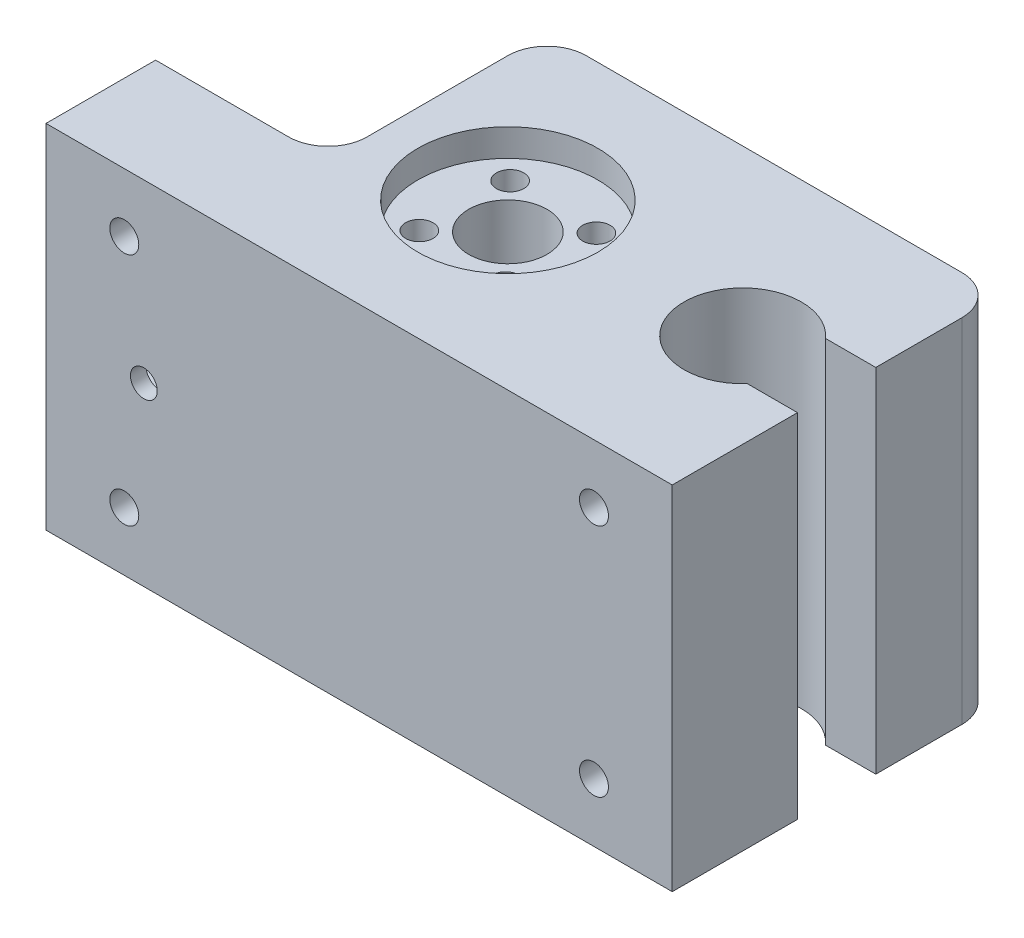
ISO-10303-21;
HEADER;
FILE_DESCRIPTION(('STEP AP214'),'2;1');
FILE_NAME('part.step','',(''),(''),'','','');
FILE_SCHEMA(('AUTOMOTIVE_DESIGN { 1 0 10303 214 1 1 1 1 }'));
ENDSEC;
DATA;
#1=APPLICATION_CONTEXT('core data for automotive mechanical design processes');
#2=APPLICATION_PROTOCOL_DEFINITION('international standard','automotive_design',2000,#1);
#3=PRODUCT_CONTEXT('',#1,'mechanical');
#4=PRODUCT('Part','Part','',(#3));
#5=PRODUCT_RELATED_PRODUCT_CATEGORY('part','',(#4));
#6=PRODUCT_DEFINITION_FORMATION('','',#4);
#7=PRODUCT_DEFINITION_CONTEXT('part definition',#1,'design');
#8=PRODUCT_DEFINITION('design','',#6,#7);
#9=PRODUCT_DEFINITION_SHAPE('','',#8);
#10=(LENGTH_UNIT() NAMED_UNIT(*) SI_UNIT(.MILLI.,.METRE.));
#11=(NAMED_UNIT(*) PLANE_ANGLE_UNIT() SI_UNIT($,.RADIAN.));
#12=(NAMED_UNIT(*) SI_UNIT($,.STERADIAN.) SOLID_ANGLE_UNIT());
#13=UNCERTAINTY_MEASURE_WITH_UNIT(LENGTH_MEASURE(1.E-05),#10,'distance_accuracy_value','');
#14=(GEOMETRIC_REPRESENTATION_CONTEXT(3) GLOBAL_UNCERTAINTY_ASSIGNED_CONTEXT((#13)) GLOBAL_UNIT_ASSIGNED_CONTEXT((#10,
#11,#12)) REPRESENTATION_CONTEXT('',''));
#15=CARTESIAN_POINT('',(0.,0.,0.));
#16=DIRECTION('',(0.,0.,1.));
#17=DIRECTION('',(1.,0.,0.));
#18=AXIS2_PLACEMENT_3D('',#15,#16,#17);
#19=CARTESIAN_POINT('',(80.,0.,42.));
#20=DIRECTION('',(-1.,0.,0.));
#21=DIRECTION('',(0.,0.,1.));
#22=AXIS2_PLACEMENT_3D('',#19,#20,#21);
#23=PLANE('',#22);
#24=DIRECTION('',(0.,0.,-1.));
#25=VECTOR('',#24,1.);
#26=CARTESIAN_POINT('',(80.,0.,42.));
#27=LINE('',#26,#25);
#28=CARTESIAN_POINT('',(80.,0.,42.));
#29=VERTEX_POINT('',#28);
#30=CARTESIAN_POINT('',(79.9999999999999,0.,25.9999999999991));
#31=VERTEX_POINT('',#30);
#32=EDGE_CURVE('E190',#29,#31,#27,.T.);
#33=ORIENTED_EDGE('',*,*,#32,.T.);
#34=DIRECTION('',(0.,1.,0.));
#35=VECTOR('',#34,1.);
#36=CARTESIAN_POINT('',(79.9999999999999,0.,25.9999999999991));
#37=LINE('',#36,#35);
#38=CARTESIAN_POINT('',(80.,45.,25.9999999999991));
#39=VERTEX_POINT('',#38);
#40=EDGE_CURVE('E183',#31,#39,#37,.T.);
#41=ORIENTED_EDGE('',*,*,#40,.T.);
#42=DIRECTION('',(0.,0.,-1.));
#43=VECTOR('',#42,1.);
#44=CARTESIAN_POINT('',(80.,45.,42.));
#45=LINE('',#44,#43);
#46=CARTESIAN_POINT('',(80.,45.,42.));
#47=VERTEX_POINT('',#46);
#48=EDGE_CURVE('E191',#47,#39,#45,.T.);
#49=ORIENTED_EDGE('',*,*,#48,.F.);
#50=DIRECTION('',(0.,1.,0.));
#51=VECTOR('',#50,1.);
#52=CARTESIAN_POINT('',(80.,0.,42.));
#53=LINE('',#52,#51);
#54=EDGE_CURVE('E289',#29,#47,#53,.T.);
#55=ORIENTED_EDGE('',*,*,#54,.F.);
#56=EDGE_LOOP('',(#33,#41,#49,#55));
#57=FACE_BOUND('',#56,.T.);
#58=ADVANCED_FACE('F40',(#57),#23,.F.);
#59=CARTESIAN_POINT('',(0.,0.,42.));
#60=DIRECTION('',(1.,0.,0.));
#61=DIRECTION('',(0.,1.,0.));
#62=AXIS2_PLACEMENT_3D('',#59,#60,#61);
#63=PLANE('',#62);
#64=DIRECTION('',(0.,0.,1.));
#65=VECTOR('',#64,1.);
#66=CARTESIAN_POINT('',(0.,14.,30.));
#67=LINE('',#66,#65);
#68=CARTESIAN_POINT('',(0.,14.,30.));
#69=VERTEX_POINT('',#68);
#70=CARTESIAN_POINT('',(0.,14.,40.));
#71=VERTEX_POINT('',#70);
#72=EDGE_CURVE('E397',#69,#71,#67,.T.);
#73=ORIENTED_EDGE('',*,*,#72,.F.);
#74=DIRECTION('',(0.,-1.,0.));
#75=VECTOR('',#74,1.);
#76=CARTESIAN_POINT('',(0.,31.,30.));
#77=LINE('',#76,#75);
#78=CARTESIAN_POINT('',(0.,31.,30.));
#79=VERTEX_POINT('',#78);
#80=EDGE_CURVE('E373',#79,#69,#77,.T.);
#81=ORIENTED_EDGE('',*,*,#80,.F.);
#82=DIRECTION('',(0.,0.,-1.));
#83=VECTOR('',#82,1.);
#84=CARTESIAN_POINT('',(0.,31.,30.));
#85=LINE('',#84,#83);
#86=CARTESIAN_POINT('',(0.,31.,40.));
#87=VERTEX_POINT('',#86);
#88=EDGE_CURVE('E382',#87,#79,#85,.T.);
#89=ORIENTED_EDGE('',*,*,#88,.F.);
#90=DIRECTION('',(0.,1.,0.));
#91=VECTOR('',#90,1.);
#92=CARTESIAN_POINT('',(0.,31.,40.));
#93=LINE('',#92,#91);
#94=EDGE_CURVE('E401',#71,#87,#93,.T.);
#95=ORIENTED_EDGE('',*,*,#94,.F.);
#96=EDGE_LOOP('',(#73,#81,#89,#95));
#97=FACE_BOUND('',#96,.T.);
#98=DIRECTION('',(0.,0.,-1.));
#99=VECTOR('',#98,1.);
#100=CARTESIAN_POINT('',(0.,45.,42.));
#101=LINE('',#100,#99);
#102=CARTESIAN_POINT('',(0.,45.,42.));
#103=VERTEX_POINT('',#102);
#104=CARTESIAN_POINT('',(0.,45.,28.));
#105=VERTEX_POINT('',#104);
#106=EDGE_CURVE('E295',#103,#105,#101,.T.);
#107=ORIENTED_EDGE('',*,*,#106,.T.);
#108=DIRECTION('',(0.,1.,0.));
#109=VECTOR('',#108,1.);
#110=CARTESIAN_POINT('',(0.,0.,28.));
#111=LINE('',#110,#109);
#112=CARTESIAN_POINT('',(0.,0.,28.));
#113=VERTEX_POINT('',#112);
#114=EDGE_CURVE('E262',#113,#105,#111,.T.);
#115=ORIENTED_EDGE('',*,*,#114,.F.);
#116=DIRECTION('',(0.,0.,-1.));
#117=VECTOR('',#116,1.);
#118=CARTESIAN_POINT('',(0.,0.,42.));
#119=LINE('',#118,#117);
#120=CARTESIAN_POINT('',(0.,0.,42.));
#121=VERTEX_POINT('',#120);
#122=EDGE_CURVE('E196',#121,#113,#119,.T.);
#123=ORIENTED_EDGE('',*,*,#122,.F.);
#124=DIRECTION('',(0.,-1.,0.));
#125=VECTOR('',#124,1.);
#126=CARTESIAN_POINT('',(0.,0.,42.));
#127=LINE('',#126,#125);
#128=EDGE_CURVE('E281',#103,#121,#127,.T.);
#129=ORIENTED_EDGE('',*,*,#128,.F.);
#130=EDGE_LOOP('',(#107,#115,#123,#129));
#131=FACE_BOUND('',#130,.T.);
#132=ADVANCED_FACE('F426',(#97,#131),#63,.F.);
#133=CARTESIAN_POINT('',(0.,0.,42.));
#134=DIRECTION('',(0.,1.,0.));
#135=DIRECTION('',(-1.,0.,0.));
#136=AXIS2_PLACEMENT_3D('',#133,#134,#135);
#137=PLANE('',#136);
#138=CARTESIAN_POINT('',(38.0000000000005,0.,20.999999999999));
#139=DIRECTION('',(0.,1.,0.));
#140=DIRECTION('',(-1.,0.,0.));
#141=AXIS2_PLACEMENT_3D('',#138,#139,#140);
#142=CIRCLE('',#141,5.0000000000057);
#143=CARTESIAN_POINT('',(32.9999999999948,0.,20.999999999999));
#144=VERTEX_POINT('',#143);
#145=EDGE_CURVE('E329',#144,#144,#142,.T.);
#146=ORIENTED_EDGE('',*,*,#145,.T.);
#147=EDGE_LOOP('',(#146));
#148=FACE_BOUND('',#147,.T.);
#149=DIRECTION('',(1.,0.,0.));
#150=VECTOR('',#149,1.);
#151=CARTESIAN_POINT('',(0.,0.,0.));
#152=LINE('',#151,#150);
#153=CARTESIAN_POINT('',(27.,0.,0.));
#154=VERTEX_POINT('',#153);
#155=CARTESIAN_POINT('',(75.,0.,0.));
#156=VERTEX_POINT('',#155);
#157=EDGE_CURVE('E274',#154,#156,#152,.T.);
#158=ORIENTED_EDGE('',*,*,#157,.T.);
#159=CARTESIAN_POINT('',(75.,0.,5.));
#160=DIRECTION('',(0.,1.,0.));
#161=DIRECTION('',(-1.,0.,0.));
#162=AXIS2_PLACEMENT_3D('',#159,#160,#161);
#163=CIRCLE('',#162,5.);
#164=CARTESIAN_POINT('',(80.,0.,5.00000000000001));
#165=VERTEX_POINT('',#164);
#166=EDGE_CURVE('E188',#156,#165,#163,.F.);
#167=ORIENTED_EDGE('',*,*,#166,.T.);
#168=CARTESIAN_POINT('',(79.9999999999999,0.,15.9999999999991));
#169=VERTEX_POINT('',#168);
#170=EDGE_CURVE('E178',#169,#165,#27,.T.);
#171=ORIENTED_EDGE('',*,*,#170,.F.);
#172=DIRECTION('',(-1.,0.,0.));
#173=VECTOR('',#172,1.);
#174=CARTESIAN_POINT('',(67.9004612587687,0.,15.9999999999991));
#175=LINE('',#174,#173);
#176=CARTESIAN_POINT('',(73.5901699437483,0.,15.9999999999991));
#177=VERTEX_POINT('',#176);
#178=EDGE_CURVE('E159',#169,#177,#175,.T.);
#179=ORIENTED_EDGE('',*,*,#178,.T.);
#180=CARTESIAN_POINT('',(68.0000000000003,0.,20.9999999999991));
#181=DIRECTION('',(0.,1.,0.));
#182=DIRECTION('',(-1.,0.,0.));
#183=AXIS2_PLACEMENT_3D('',#180,#181,#182);
#184=CIRCLE('',#183,7.49999999999887);
#185=CARTESIAN_POINT('',(73.5901699437483,0.,25.9999999999991));
#186=VERTEX_POINT('',#185);
#187=EDGE_CURVE('E323',#177,#186,#184,.T.);
#188=ORIENTED_EDGE('',*,*,#187,.T.);
#189=DIRECTION('',(1.,0.,0.));
#190=VECTOR('',#189,1.);
#191=CARTESIAN_POINT('',(67.9004612587687,0.,25.9999999999991));
#192=LINE('',#191,#190);
#193=EDGE_CURVE('E170',#186,#31,#192,.T.);
#194=ORIENTED_EDGE('',*,*,#193,.T.);
#195=ORIENTED_EDGE('',*,*,#32,.F.);
#196=DIRECTION('',(1.,0.,0.));
#197=VECTOR('',#196,1.);
#198=CARTESIAN_POINT('',(0.,0.,42.));
#199=LINE('',#198,#197);
#200=EDGE_CURVE('E285',#121,#29,#199,.T.);
#201=ORIENTED_EDGE('',*,*,#200,.F.);
#202=ORIENTED_EDGE('',*,*,#122,.T.);
#203=DIRECTION('',(1.,0.,0.));
#204=VECTOR('',#203,1.);
#205=CARTESIAN_POINT('',(0.,0.,28.));
#206=LINE('',#205,#204);
#207=CARTESIAN_POINT('',(17.,0.,28.));
#208=VERTEX_POINT('',#207);
#209=EDGE_CURVE('E270',#113,#208,#206,.T.);
#210=ORIENTED_EDGE('',*,*,#209,.T.);
#211=CARTESIAN_POINT('',(17.,0.,23.));
#212=DIRECTION('',(0.,1.,0.));
#213=DIRECTION('',(-1.,0.,0.));
#214=AXIS2_PLACEMENT_3D('',#211,#212,#213);
#215=CIRCLE('',#214,5.);
#216=CARTESIAN_POINT('',(22.,0.,23.));
#217=VERTEX_POINT('',#216);
#218=EDGE_CURVE('E11',#208,#217,#215,.T.);
#219=ORIENTED_EDGE('',*,*,#218,.T.);
#220=DIRECTION('',(0.,0.,-1.));
#221=VECTOR('',#220,1.);
#222=CARTESIAN_POINT('',(22.,0.,28.));
#223=LINE('',#222,#221);
#224=CARTESIAN_POINT('',(22.,0.,5.));
#225=VERTEX_POINT('',#224);
#226=EDGE_CURVE('E267',#217,#225,#223,.T.);
#227=ORIENTED_EDGE('',*,*,#226,.T.);
#228=CARTESIAN_POINT('',(27.,0.,5.));
#229=DIRECTION('',(0.,1.,0.));
#230=DIRECTION('',(-1.,0.,0.));
#231=AXIS2_PLACEMENT_3D('',#228,#229,#230);
#232=CIRCLE('',#231,5.);
#233=EDGE_CURVE('E232',#225,#154,#232,.F.);
#234=ORIENTED_EDGE('',*,*,#233,.T.);
#235=EDGE_LOOP('',(#158,#167,#171,#179,#188,#194,#195,#201,#202,#210,#219,#227,#234));
#236=FACE_BOUND('',#235,.T.);
#237=ADVANCED_FACE('F186',(#148,#236),#137,.F.);
#238=ORIENTED_EDGE('',*,*,#170,.T.);
#239=DIRECTION('',(0.,1.,0.));
#240=VECTOR('',#239,1.);
#241=CARTESIAN_POINT('',(80.,45.,5.));
#242=LINE('',#241,#240);
#243=CARTESIAN_POINT('',(80.,45.,5.00000000000001));
#244=VERTEX_POINT('',#243);
#245=EDGE_CURVE('E210',#165,#244,#242,.T.);
#246=ORIENTED_EDGE('',*,*,#245,.T.);
#247=CARTESIAN_POINT('',(80.,45.,15.9999999999991));
#248=VERTEX_POINT('',#247);
#249=EDGE_CURVE('E181',#248,#244,#45,.T.);
#250=ORIENTED_EDGE('',*,*,#249,.F.);
#251=DIRECTION('',(0.,1.,0.));
#252=VECTOR('',#251,1.);
#253=CARTESIAN_POINT('',(79.9999999999999,0.,15.9999999999991));
#254=LINE('',#253,#252);
#255=EDGE_CURVE('E162',#169,#248,#254,.T.);
#256=ORIENTED_EDGE('',*,*,#255,.F.);
#257=EDGE_LOOP('',(#238,#246,#250,#256));
#258=FACE_BOUND('',#257,.T.);
#259=ADVANCED_FACE('F176',(#258),#23,.F.);
#260=CARTESIAN_POINT('',(0.,45.,42.));
#261=DIRECTION('',(0.,-1.,0.));
#262=DIRECTION('',(1.,0.,0.));
#263=AXIS2_PLACEMENT_3D('',#260,#261,#262);
#264=PLANE('',#263);
#265=ORIENTED_EDGE('',*,*,#249,.T.);
#266=CARTESIAN_POINT('',(75.,45.,5.));
#267=DIRECTION('',(0.,-1.,0.));
#268=DIRECTION('',(1.,0.,0.));
#269=AXIS2_PLACEMENT_3D('',#266,#267,#268);
#270=CIRCLE('',#269,5.);
#271=CARTESIAN_POINT('',(75.,45.,0.));
#272=VERTEX_POINT('',#271);
#273=EDGE_CURVE('E222',#244,#272,#270,.F.);
#274=ORIENTED_EDGE('',*,*,#273,.T.);
#275=DIRECTION('',(-1.,0.,0.));
#276=VECTOR('',#275,1.);
#277=CARTESIAN_POINT('',(0.,45.,0.));
#278=LINE('',#277,#276);
#279=CARTESIAN_POINT('',(27.,45.,0.));
#280=VERTEX_POINT('',#279);
#281=EDGE_CURVE('E286',#272,#280,#278,.T.);
#282=ORIENTED_EDGE('',*,*,#281,.T.);
#283=CARTESIAN_POINT('',(27.,45.,5.));
#284=DIRECTION('',(0.,-1.,0.));
#285=DIRECTION('',(1.,0.,0.));
#286=AXIS2_PLACEMENT_3D('',#283,#284,#285);
#287=CIRCLE('',#286,5.);
#288=CARTESIAN_POINT('',(22.,45.,5.));
#289=VERTEX_POINT('',#288);
#290=EDGE_CURVE('E219',#280,#289,#287,.F.);
#291=ORIENTED_EDGE('',*,*,#290,.T.);
#292=DIRECTION('',(0.,0.,-1.));
#293=VECTOR('',#292,1.);
#294=CARTESIAN_POINT('',(22.,45.,28.));
#295=LINE('',#294,#293);
#296=CARTESIAN_POINT('',(22.,45.,23.));
#297=VERTEX_POINT('',#296);
#298=EDGE_CURVE('E255',#297,#289,#295,.T.);
#299=ORIENTED_EDGE('',*,*,#298,.F.);
#300=CARTESIAN_POINT('',(17.,45.,23.));
#301=DIRECTION('',(0.,-1.,0.));
#302=DIRECTION('',(1.,0.,0.));
#303=AXIS2_PLACEMENT_3D('',#300,#301,#302);
#304=CIRCLE('',#303,5.);
#305=CARTESIAN_POINT('',(17.,45.,28.));
#306=VERTEX_POINT('',#305);
#307=EDGE_CURVE('E49',#297,#306,#304,.T.);
#308=ORIENTED_EDGE('',*,*,#307,.T.);
#309=DIRECTION('',(1.,0.,0.));
#310=VECTOR('',#309,1.);
#311=CARTESIAN_POINT('',(0.,45.,28.));
#312=LINE('',#311,#310);
#313=EDGE_CURVE('E253',#105,#306,#312,.T.);
#314=ORIENTED_EDGE('',*,*,#313,.F.);
#315=ORIENTED_EDGE('',*,*,#106,.F.);
#316=DIRECTION('',(-1.,0.,0.));
#317=VECTOR('',#316,1.);
#318=CARTESIAN_POINT('',(0.,45.,42.));
#319=LINE('',#318,#317);
#320=EDGE_CURVE('E292',#47,#103,#319,.T.);
#321=ORIENTED_EDGE('',*,*,#320,.F.);
#322=ORIENTED_EDGE('',*,*,#48,.T.);
#323=DIRECTION('',(1.,0.,0.));
#324=VECTOR('',#323,1.);
#325=CARTESIAN_POINT('',(67.9004612587687,45.,25.9999999999991));
#326=LINE('',#325,#324);
#327=CARTESIAN_POINT('',(73.5901699437483,45.,25.9999999999991));
#328=VERTEX_POINT('',#327);
#329=EDGE_CURVE('E171',#328,#39,#326,.T.);
#330=ORIENTED_EDGE('',*,*,#329,.F.);
#331=CARTESIAN_POINT('',(68.0000000000003,45.,20.9999999999991));
#332=DIRECTION('',(0.,1.,0.));
#333=DIRECTION('',(-1.,0.,0.));
#334=AXIS2_PLACEMENT_3D('',#331,#332,#333);
#335=CIRCLE('',#334,7.49999999999887);
#336=CARTESIAN_POINT('',(73.5901699437483,45.,15.9999999999991));
#337=VERTEX_POINT('',#336);
#338=EDGE_CURVE('E309',#337,#328,#335,.T.);
#339=ORIENTED_EDGE('',*,*,#338,.F.);
#340=DIRECTION('',(-1.,0.,0.));
#341=VECTOR('',#340,1.);
#342=CARTESIAN_POINT('',(67.9004612587687,45.,15.9999999999991));
#343=LINE('',#342,#341);
#344=EDGE_CURVE('E306',#248,#337,#343,.T.);
#345=ORIENTED_EDGE('',*,*,#344,.F.);
#346=EDGE_LOOP('',(#265,#274,#282,#291,#299,#308,#314,#315,#321,#322,#330,#339,#345));
#347=FACE_BOUND('',#346,.T.);
#348=CARTESIAN_POINT('',(37.9999999999973,45.,21.0000000000019));
#349=DIRECTION('',(0.,1.,0.));
#350=DIRECTION('',(-1.,0.,0.));
#351=AXIS2_PLACEMENT_3D('',#348,#349,#350);
#352=CIRCLE('',#351,11.5000000000832);
#353=CARTESIAN_POINT('',(26.4999999999141,45.,21.0000000000019));
#354=VERTEX_POINT('',#353);
#355=EDGE_CURVE('E365',#354,#354,#352,.T.);
#356=ORIENTED_EDGE('',*,*,#355,.F.);
#357=EDGE_LOOP('',(#356));
#358=FACE_BOUND('',#357,.T.);
#359=ADVANCED_FACE('F250',(#347,#358),#264,.F.);
#360=CARTESIAN_POINT('',(0.,0.,42.));
#361=DIRECTION('',(0.,0.,-1.));
#362=DIRECTION('',(-1.,0.,0.));
#363=AXIS2_PLACEMENT_3D('',#360,#361,#362);
#364=PLANE('',#363);
#365=CARTESIAN_POINT('',(9.99999999999999,7.5,42.));
#366=DIRECTION('',(0.,0.,1.));
#367=DIRECTION('',(1.,0.,0.));
#368=AXIS2_PLACEMENT_3D('',#365,#366,#367);
#369=CIRCLE('',#368,1.85);
#370=CARTESIAN_POINT('',(11.85,7.5,42.));
#371=VERTEX_POINT('',#370);
#372=EDGE_CURVE('E620',#371,#371,#369,.T.);
#373=ORIENTED_EDGE('',*,*,#372,.F.);
#374=EDGE_LOOP('',(#373));
#375=FACE_BOUND('',#374,.T.);
#376=CARTESIAN_POINT('',(70.,7.5,42.));
#377=DIRECTION('',(0.,0.,1.));
#378=DIRECTION('',(1.,0.,0.));
#379=AXIS2_PLACEMENT_3D('',#376,#377,#378);
#380=CIRCLE('',#379,1.85);
#381=CARTESIAN_POINT('',(71.85,7.5,42.));
#382=VERTEX_POINT('',#381);
#383=EDGE_CURVE('E612',#382,#382,#380,.T.);
#384=ORIENTED_EDGE('',*,*,#383,.F.);
#385=EDGE_LOOP('',(#384));
#386=FACE_BOUND('',#385,.T.);
#387=CARTESIAN_POINT('',(70.,37.5,42.));
#388=DIRECTION('',(0.,0.,1.));
#389=DIRECTION('',(1.,0.,0.));
#390=AXIS2_PLACEMENT_3D('',#387,#388,#389);
#391=CIRCLE('',#390,1.85000000000001);
#392=CARTESIAN_POINT('',(71.85,37.5,42.));
#393=VERTEX_POINT('',#392);
#394=EDGE_CURVE('E598',#393,#393,#391,.T.);
#395=ORIENTED_EDGE('',*,*,#394,.F.);
#396=EDGE_LOOP('',(#395));
#397=FACE_BOUND('',#396,.T.);
#398=CARTESIAN_POINT('',(9.99999999999999,37.5,42.));
#399=DIRECTION('',(0.,0.,1.));
#400=DIRECTION('',(1.,0.,0.));
#401=AXIS2_PLACEMENT_3D('',#398,#399,#400);
#402=CIRCLE('',#401,1.85);
#403=CARTESIAN_POINT('',(11.85,37.5,42.));
#404=VERTEX_POINT('',#403);
#405=EDGE_CURVE('E597',#404,#404,#402,.T.);
#406=ORIENTED_EDGE('',*,*,#405,.F.);
#407=EDGE_LOOP('',(#406));
#408=FACE_BOUND('',#407,.T.);
#409=CARTESIAN_POINT('',(12.5000000000308,22.5000000009867,42.));
#410=DIRECTION('',(0.,0.,1.));
#411=DIRECTION('',(1.,0.,0.));
#412=AXIS2_PLACEMENT_3D('',#409,#410,#411);
#413=CIRCLE('',#412,1.71233253274656);
#414=CARTESIAN_POINT('',(14.2123325327774,22.5000000009867,42.));
#415=VERTEX_POINT('',#414);
#416=EDGE_CURVE('E216',#415,#415,#413,.T.);
#417=ORIENTED_EDGE('',*,*,#416,.F.);
#418=EDGE_LOOP('',(#417));
#419=FACE_BOUND('',#418,.T.);
#420=ORIENTED_EDGE('',*,*,#128,.T.);
#421=ORIENTED_EDGE('',*,*,#200,.T.);
#422=ORIENTED_EDGE('',*,*,#54,.T.);
#423=ORIENTED_EDGE('',*,*,#320,.T.);
#424=EDGE_LOOP('',(#420,#421,#422,#423));
#425=FACE_BOUND('',#424,.T.);
#426=ADVANCED_FACE('F462',(#375,#386,#397,#408,#419,#425),#364,.F.);
#427=CARTESIAN_POINT('',(0.,0.,0.));
#428=DIRECTION('',(0.,0.,-1.));
#429=DIRECTION('',(-1.,0.,0.));
#430=AXIS2_PLACEMENT_3D('',#427,#428,#429);
#431=PLANE('',#430);
#432=ORIENTED_EDGE('',*,*,#281,.F.);
#433=DIRECTION('',(0.,1.,0.));
#434=VECTOR('',#433,1.);
#435=CARTESIAN_POINT('',(75.,0.,0.));
#436=LINE('',#435,#434);
#437=EDGE_CURVE('E229',#272,#156,#436,.F.);
#438=ORIENTED_EDGE('',*,*,#437,.T.);
#439=ORIENTED_EDGE('',*,*,#157,.F.);
#440=DIRECTION('',(0.,1.,0.));
#441=VECTOR('',#440,1.);
#442=CARTESIAN_POINT('',(27.,45.,0.));
#443=LINE('',#442,#441);
#444=EDGE_CURVE('E225',#154,#280,#443,.T.);
#445=ORIENTED_EDGE('',*,*,#444,.T.);
#446=EDGE_LOOP('',(#432,#438,#439,#445));
#447=FACE_BOUND('',#446,.T.);
#448=ADVANCED_FACE('F480',(#447),#431,.T.);
#449=CARTESIAN_POINT('',(22.,0.,28.));
#450=DIRECTION('',(1.,0.,0.));
#451=DIRECTION('',(0.,0.,-1.));
#452=AXIS2_PLACEMENT_3D('',#449,#450,#451);
#453=PLANE('',#452);
#454=ORIENTED_EDGE('',*,*,#298,.T.);
#455=DIRECTION('',(0.,1.,0.));
#456=VECTOR('',#455,1.);
#457=CARTESIAN_POINT('',(22.,0.,5.));
#458=LINE('',#457,#456);
#459=EDGE_CURVE('E56',#289,#225,#458,.F.);
#460=ORIENTED_EDGE('',*,*,#459,.T.);
#461=ORIENTED_EDGE('',*,*,#226,.F.);
#462=DIRECTION('',(0.,1.,0.));
#463=VECTOR('',#462,1.);
#464=CARTESIAN_POINT('',(22.,45.,23.));
#465=LINE('',#464,#463);
#466=EDGE_CURVE('E237',#217,#297,#465,.T.);
#467=ORIENTED_EDGE('',*,*,#466,.T.);
#468=EDGE_LOOP('',(#454,#460,#461,#467));
#469=FACE_BOUND('',#468,.T.);
#470=ADVANCED_FACE('F266',(#469),#453,.F.);
#471=CARTESIAN_POINT('',(0.,0.,28.));
#472=DIRECTION('',(0.,0.,1.));
#473=DIRECTION('',(1.,0.,0.));
#474=AXIS2_PLACEMENT_3D('',#471,#472,#473);
#475=PLANE('',#474);
#476=CARTESIAN_POINT('',(12.5000000000308,22.5000000009867,28.));
#477=DIRECTION('',(0.,0.,1.));
#478=DIRECTION('',(1.,0.,0.));
#479=AXIS2_PLACEMENT_3D('',#476,#477,#478);
#480=CIRCLE('',#479,1.71233253274656);
#481=CARTESIAN_POINT('',(14.2123325327774,22.5000000009867,28.));
#482=VERTEX_POINT('',#481);
#483=EDGE_CURVE('E311',#482,#482,#480,.T.);
#484=ORIENTED_EDGE('',*,*,#483,.T.);
#485=EDGE_LOOP('',(#484));
#486=FACE_BOUND('',#485,.T.);
#487=ORIENTED_EDGE('',*,*,#313,.T.);
#488=DIRECTION('',(0.,1.,0.));
#489=VECTOR('',#488,1.);
#490=CARTESIAN_POINT('',(17.,0.,28.));
#491=LINE('',#490,#489);
#492=EDGE_CURVE('E243',#306,#208,#491,.F.);
#493=ORIENTED_EDGE('',*,*,#492,.T.);
#494=ORIENTED_EDGE('',*,*,#209,.F.);
#495=ORIENTED_EDGE('',*,*,#114,.T.);
#496=EDGE_LOOP('',(#487,#493,#494,#495));
#497=FACE_BOUND('',#496,.T.);
#498=ADVANCED_FACE('F260',(#486,#497),#475,.F.);
#499=CARTESIAN_POINT('',(28.,31.,30.));
#500=DIRECTION('',(0.,0.,-1.));
#501=DIRECTION('',(-1.,0.,0.));
#502=AXIS2_PLACEMENT_3D('',#499,#500,#501);
#503=PLANE('',#502);
#504=CARTESIAN_POINT('',(12.5000000000308,22.5000000009867,30.));
#505=DIRECTION('',(0.,0.,-1.));
#506=DIRECTION('',(-1.,0.,0.));
#507=AXIS2_PLACEMENT_3D('',#504,#505,#506);
#508=CIRCLE('',#507,1.71233253274656);
#509=CARTESIAN_POINT('',(10.7876674672842,22.5000000009867,30.));
#510=VERTEX_POINT('',#509);
#511=EDGE_CURVE('E215',#510,#510,#508,.T.);
#512=ORIENTED_EDGE('',*,*,#511,.T.);
#513=EDGE_LOOP('',(#512));
#514=FACE_BOUND('',#513,.T.);
#515=ORIENTED_EDGE('',*,*,#80,.T.);
#516=DIRECTION('',(-1.,0.,0.));
#517=VECTOR('',#516,1.);
#518=CARTESIAN_POINT('',(28.,14.,30.));
#519=LINE('',#518,#517);
#520=CARTESIAN_POINT('',(28.,14.,30.));
#521=VERTEX_POINT('',#520);
#522=EDGE_CURVE('E394',#521,#69,#519,.T.);
#523=ORIENTED_EDGE('',*,*,#522,.F.);
#524=DIRECTION('',(0.,-1.,0.));
#525=VECTOR('',#524,1.);
#526=CARTESIAN_POINT('',(28.,31.,30.));
#527=LINE('',#526,#525);
#528=CARTESIAN_POINT('',(28.,31.,30.));
#529=VERTEX_POINT('',#528);
#530=EDGE_CURVE('E377',#529,#521,#527,.T.);
#531=ORIENTED_EDGE('',*,*,#530,.F.);
#532=DIRECTION('',(-1.,0.,0.));
#533=VECTOR('',#532,1.);
#534=CARTESIAN_POINT('',(28.,31.,30.));
#535=LINE('',#534,#533);
#536=EDGE_CURVE('E264',#529,#79,#535,.T.);
#537=ORIENTED_EDGE('',*,*,#536,.T.);
#538=EDGE_LOOP('',(#515,#523,#531,#537));
#539=FACE_BOUND('',#538,.T.);
#540=ADVANCED_FACE('F434',(#514,#539),#503,.F.);
#541=CARTESIAN_POINT('',(28.,31.,30.));
#542=DIRECTION('',(0.,1.,0.));
#543=DIRECTION('',(-1.,0.,0.));
#544=AXIS2_PLACEMENT_3D('',#541,#542,#543);
#545=PLANE('',#544);
#546=ORIENTED_EDGE('',*,*,#88,.T.);
#547=ORIENTED_EDGE('',*,*,#536,.F.);
#548=DIRECTION('',(0.,0.,-1.));
#549=VECTOR('',#548,1.);
#550=CARTESIAN_POINT('',(28.,31.,30.));
#551=LINE('',#550,#549);
#552=CARTESIAN_POINT('',(28.,31.,40.));
#553=VERTEX_POINT('',#552);
#554=EDGE_CURVE('E390',#553,#529,#551,.T.);
#555=ORIENTED_EDGE('',*,*,#554,.F.);
#556=DIRECTION('',(-1.,0.,0.));
#557=VECTOR('',#556,1.);
#558=CARTESIAN_POINT('',(28.,31.,40.));
#559=LINE('',#558,#557);
#560=EDGE_CURVE('E410',#553,#87,#559,.T.);
#561=ORIENTED_EDGE('',*,*,#560,.T.);
#562=EDGE_LOOP('',(#546,#547,#555,#561));
#563=FACE_BOUND('',#562,.T.);
#564=ADVANCED_FACE('F436',(#563),#545,.F.);
#565=CARTESIAN_POINT('',(28.,31.,40.));
#566=DIRECTION('',(0.,0.,1.));
#567=DIRECTION('',(1.,0.,0.));
#568=AXIS2_PLACEMENT_3D('',#565,#566,#567);
#569=PLANE('',#568);
#570=CARTESIAN_POINT('',(12.5000000000308,22.5000000009867,40.));
#571=DIRECTION('',(0.,0.,1.));
#572=DIRECTION('',(1.,0.,0.));
#573=AXIS2_PLACEMENT_3D('',#570,#571,#572);
#574=CIRCLE('',#573,1.71233253274656);
#575=CARTESIAN_POINT('',(14.2123325327774,22.5000000009867,40.));
#576=VERTEX_POINT('',#575);
#577=EDGE_CURVE('E211',#576,#576,#574,.T.);
#578=ORIENTED_EDGE('',*,*,#577,.T.);
#579=EDGE_LOOP('',(#578));
#580=FACE_BOUND('',#579,.T.);
#581=ORIENTED_EDGE('',*,*,#94,.T.);
#582=ORIENTED_EDGE('',*,*,#560,.F.);
#583=DIRECTION('',(0.,1.,0.));
#584=VECTOR('',#583,1.);
#585=CARTESIAN_POINT('',(28.,31.,40.));
#586=LINE('',#585,#584);
#587=CARTESIAN_POINT('',(28.,14.,40.));
#588=VERTEX_POINT('',#587);
#589=EDGE_CURVE('E386',#588,#553,#586,.T.);
#590=ORIENTED_EDGE('',*,*,#589,.F.);
#591=DIRECTION('',(-1.,0.,0.));
#592=VECTOR('',#591,1.);
#593=CARTESIAN_POINT('',(28.,14.,40.));
#594=LINE('',#593,#592);
#595=EDGE_CURVE('E413',#588,#71,#594,.T.);
#596=ORIENTED_EDGE('',*,*,#595,.T.);
#597=EDGE_LOOP('',(#581,#582,#590,#596));
#598=FACE_BOUND('',#597,.T.);
#599=ADVANCED_FACE('F429',(#580,#598),#569,.F.);
#600=CARTESIAN_POINT('',(28.,14.,30.));
#601=DIRECTION('',(0.,-1.,0.));
#602=DIRECTION('',(1.,0.,0.));
#603=AXIS2_PLACEMENT_3D('',#600,#601,#602);
#604=PLANE('',#603);
#605=ORIENTED_EDGE('',*,*,#72,.T.);
#606=ORIENTED_EDGE('',*,*,#595,.F.);
#607=DIRECTION('',(0.,0.,1.));
#608=VECTOR('',#607,1.);
#609=CARTESIAN_POINT('',(28.,14.,30.));
#610=LINE('',#609,#608);
#611=EDGE_CURVE('E381',#521,#588,#610,.T.);
#612=ORIENTED_EDGE('',*,*,#611,.F.);
#613=ORIENTED_EDGE('',*,*,#522,.T.);
#614=EDGE_LOOP('',(#605,#606,#612,#613));
#615=FACE_BOUND('',#614,.T.);
#616=ADVANCED_FACE('F420',(#615),#604,.F.);
#617=CARTESIAN_POINT('',(28.,0.,0.));
#618=DIRECTION('',(-1.,0.,0.));
#619=DIRECTION('',(0.,-1.,0.));
#620=AXIS2_PLACEMENT_3D('',#617,#618,#619);
#621=PLANE('',#620);
#622=ORIENTED_EDGE('',*,*,#530,.T.);
#623=ORIENTED_EDGE('',*,*,#611,.T.);
#624=ORIENTED_EDGE('',*,*,#589,.T.);
#625=ORIENTED_EDGE('',*,*,#554,.T.);
#626=EDGE_LOOP('',(#622,#623,#624,#625));
#627=FACE_BOUND('',#626,.T.);
#628=ADVANCED_FACE('F433',(#627),#621,.T.);
#629=CARTESIAN_POINT('',(37.9999999999973,41.5,21.0000000000019));
#630=DIRECTION('',(0.,1.,0.));
#631=DIRECTION('',(-1.,0.,0.));
#632=AXIS2_PLACEMENT_3D('',#629,#630,#631);
#633=CYLINDRICAL_SURFACE('',#632,11.5000000000832);
#634=CARTESIAN_POINT('',(37.9999999999973,41.5,21.0000000000019));
#635=DIRECTION('',(0.,1.,0.));
#636=DIRECTION('',(-1.,0.,0.));
#637=AXIS2_PLACEMENT_3D('',#634,#635,#636);
#638=CIRCLE('',#637,11.5000000000832);
#639=CARTESIAN_POINT('',(26.4999999999141,41.5,21.0000000000019));
#640=VERTEX_POINT('',#639);
#641=EDGE_CURVE('E369',#640,#640,#638,.T.);
#642=ORIENTED_EDGE('',*,*,#641,.F.);
#643=EDGE_LOOP('',(#642));
#644=FACE_BOUND('',#643,.T.);
#645=ORIENTED_EDGE('',*,*,#355,.T.);
#646=EDGE_LOOP('',(#645));
#647=FACE_BOUND('',#646,.T.);
#648=ADVANCED_FACE('F499',(#644,#647),#633,.F.);
#649=CARTESIAN_POINT('',(37.9999999999973,41.5,21.0000000000019));
#650=DIRECTION('',(0.,1.,0.));
#651=DIRECTION('',(-1.,0.,0.));
#652=AXIS2_PLACEMENT_3D('',#649,#650,#651);
#653=PLANE('',#652);
#654=CARTESIAN_POINT('',(38.0000000000005,41.5,20.999999999999));
#655=DIRECTION('',(0.,1.,0.));
#656=DIRECTION('',(-1.,0.,0.));
#657=AXIS2_PLACEMENT_3D('',#654,#655,#656);
#658=CIRCLE('',#657,5.0000000000057);
#659=CARTESIAN_POINT('',(32.9999999999948,41.5,20.999999999999));
#660=VERTEX_POINT('',#659);
#661=EDGE_CURVE('E326',#660,#660,#658,.T.);
#662=ORIENTED_EDGE('',*,*,#661,.F.);
#663=EDGE_LOOP('',(#662));
#664=FACE_BOUND('',#663,.T.);
#665=CARTESIAN_POINT('',(43.5117163917615,41.5,26.7983603214001));
#666=DIRECTION('',(0.,1.,0.));
#667=DIRECTION('',(-1.,0.,0.));
#668=AXIS2_PLACEMENT_3D('',#665,#666,#667);
#669=CIRCLE('',#668,1.75000000000674);
#670=CARTESIAN_POINT('',(41.7617163917547,41.5,26.7983603214001));
#671=VERTEX_POINT('',#670);
#672=EDGE_CURVE('E333',#671,#671,#669,.T.);
#673=ORIENTED_EDGE('',*,*,#672,.F.);
#674=EDGE_LOOP('',(#673));
#675=FACE_BOUND('',#674,.T.);
#676=CARTESIAN_POINT('',(43.7983603213962,41.5,15.4882836082384));
#677=DIRECTION('',(0.,1.,0.));
#678=DIRECTION('',(-1.,0.,0.));
#679=AXIS2_PLACEMENT_3D('',#676,#677,#678);
#680=CIRCLE('',#679,1.75000000000655);
#681=CARTESIAN_POINT('',(42.0483603213897,41.5,15.4882836082384));
#682=VERTEX_POINT('',#681);
#683=EDGE_CURVE('E350',#682,#682,#680,.T.);
#684=ORIENTED_EDGE('',*,*,#683,.F.);
#685=EDGE_LOOP('',(#684));
#686=FACE_BOUND('',#685,.T.);
#687=CARTESIAN_POINT('',(32.4882836082345,41.5,15.2016396786036));
#688=DIRECTION('',(0.,1.,0.));
#689=DIRECTION('',(-1.,0.,0.));
#690=AXIS2_PLACEMENT_3D('',#687,#688,#689);
#691=CIRCLE('',#690,1.75000000000693);
#692=CARTESIAN_POINT('',(30.7382836082275,41.5,15.2016396786036));
#693=VERTEX_POINT('',#692);
#694=EDGE_CURVE('E342',#693,#693,#691,.T.);
#695=ORIENTED_EDGE('',*,*,#694,.F.);
#696=EDGE_LOOP('',(#695));
#697=FACE_BOUND('',#696,.T.);
#698=CARTESIAN_POINT('',(32.2016396785997,41.5,26.5117163917653));
#699=DIRECTION('',(0.,1.,0.));
#700=DIRECTION('',(-1.,0.,0.));
#701=AXIS2_PLACEMENT_3D('',#698,#699,#700);
#702=CIRCLE('',#701,1.75000000000703);
#703=CARTESIAN_POINT('',(30.4516396785927,41.5,26.5117163917653));
#704=VERTEX_POINT('',#703);
#705=EDGE_CURVE('E341',#704,#704,#702,.T.);
#706=ORIENTED_EDGE('',*,*,#705,.F.);
#707=EDGE_LOOP('',(#706));
#708=FACE_BOUND('',#707,.T.);
#709=ORIENTED_EDGE('',*,*,#641,.T.);
#710=EDGE_LOOP('',(#709));
#711=FACE_BOUND('',#710,.T.);
#712=ADVANCED_FACE('F503',(#664,#675,#686,#697,#708,#711),#653,.T.);
#713=CARTESIAN_POINT('',(32.2016396785997,31.5,26.5117163917653));
#714=DIRECTION('',(0.,1.,0.));
#715=DIRECTION('',(-1.,0.,0.));
#716=AXIS2_PLACEMENT_3D('',#713,#714,#715);
#717=CYLINDRICAL_SURFACE('',#716,1.75000000000703);
#718=CARTESIAN_POINT('',(32.2016396785997,31.5,26.5117163917653));
#719=DIRECTION('',(0.,1.,0.));
#720=DIRECTION('',(-1.,0.,0.));
#721=AXIS2_PLACEMENT_3D('',#718,#719,#720);
#722=CIRCLE('',#721,1.75000000000703);
#723=CARTESIAN_POINT('',(30.4516396785927,31.5,26.5117163917653));
#724=VERTEX_POINT('',#723);
#725=EDGE_CURVE('E361',#724,#724,#722,.T.);
#726=ORIENTED_EDGE('',*,*,#725,.F.);
#727=EDGE_LOOP('',(#726));
#728=FACE_BOUND('',#727,.T.);
#729=ORIENTED_EDGE('',*,*,#705,.T.);
#730=EDGE_LOOP('',(#729));
#731=FACE_BOUND('',#730,.T.);
#732=ADVANCED_FACE('F509',(#728,#731),#717,.F.);
#733=CARTESIAN_POINT('',(32.2016396785997,31.5,26.5117163917653));
#734=DIRECTION('',(0.,1.,0.));
#735=DIRECTION('',(-1.,0.,0.));
#736=AXIS2_PLACEMENT_3D('',#733,#734,#735);
#737=PLANE('',#736);
#738=ORIENTED_EDGE('',*,*,#725,.T.);
#739=EDGE_LOOP('',(#738));
#740=FACE_BOUND('',#739,.T.);
#741=ADVANCED_FACE('F513',(#740),#737,.T.);
#742=CARTESIAN_POINT('',(32.4882836082345,31.5,15.2016396786036));
#743=DIRECTION('',(0.,1.,0.));
#744=DIRECTION('',(-1.,0.,0.));
#745=AXIS2_PLACEMENT_3D('',#742,#743,#744);
#746=CYLINDRICAL_SURFACE('',#745,1.75000000000693);
#747=CARTESIAN_POINT('',(32.4882836082345,31.5,15.2016396786036));
#748=DIRECTION('',(0.,1.,0.));
#749=DIRECTION('',(-1.,0.,0.));
#750=AXIS2_PLACEMENT_3D('',#747,#748,#749);
#751=CIRCLE('',#750,1.75000000000693);
#752=CARTESIAN_POINT('',(30.7382836082275,31.5,15.2016396786036));
#753=VERTEX_POINT('',#752);
#754=EDGE_CURVE('E337',#753,#753,#751,.T.);
#755=ORIENTED_EDGE('',*,*,#754,.F.);
#756=EDGE_LOOP('',(#755));
#757=FACE_BOUND('',#756,.T.);
#758=ORIENTED_EDGE('',*,*,#694,.T.);
#759=EDGE_LOOP('',(#758));
#760=FACE_BOUND('',#759,.T.);
#761=ADVANCED_FACE('F517',(#757,#760),#746,.F.);
#762=CARTESIAN_POINT('',(32.4882836082345,31.5,15.2016396786036));
#763=DIRECTION('',(0.,1.,0.));
#764=DIRECTION('',(-1.,0.,0.));
#765=AXIS2_PLACEMENT_3D('',#762,#763,#764);
#766=PLANE('',#765);
#767=ORIENTED_EDGE('',*,*,#754,.T.);
#768=EDGE_LOOP('',(#767));
#769=FACE_BOUND('',#768,.T.);
#770=ADVANCED_FACE('F532',(#769),#766,.T.);
#771=CARTESIAN_POINT('',(43.7983603213962,31.5,15.4882836082384));
#772=DIRECTION('',(0.,1.,0.));
#773=DIRECTION('',(-1.,0.,0.));
#774=AXIS2_PLACEMENT_3D('',#771,#772,#773);
#775=CYLINDRICAL_SURFACE('',#774,1.75000000000655);
#776=CARTESIAN_POINT('',(43.7983603213962,31.5,15.4882836082384));
#777=DIRECTION('',(0.,1.,0.));
#778=DIRECTION('',(-1.,0.,0.));
#779=AXIS2_PLACEMENT_3D('',#776,#777,#778);
#780=CIRCLE('',#779,1.75000000000655);
#781=CARTESIAN_POINT('',(42.0483603213897,31.5,15.4882836082384));
#782=VERTEX_POINT('',#781);
#783=EDGE_CURVE('E346',#782,#782,#780,.T.);
#784=ORIENTED_EDGE('',*,*,#783,.F.);
#785=EDGE_LOOP('',(#784));
#786=FACE_BOUND('',#785,.T.);
#787=ORIENTED_EDGE('',*,*,#683,.T.);
#788=EDGE_LOOP('',(#787));
#789=FACE_BOUND('',#788,.T.);
#790=ADVANCED_FACE('F529',(#786,#789),#775,.F.);
#791=CARTESIAN_POINT('',(43.7983603213962,31.5,15.4882836082384));
#792=DIRECTION('',(0.,1.,0.));
#793=DIRECTION('',(-1.,0.,0.));
#794=AXIS2_PLACEMENT_3D('',#791,#792,#793);
#795=PLANE('',#794);
#796=ORIENTED_EDGE('',*,*,#783,.T.);
#797=EDGE_LOOP('',(#796));
#798=FACE_BOUND('',#797,.T.);
#799=ADVANCED_FACE('F523',(#798),#795,.T.);
#800=CARTESIAN_POINT('',(43.5117163917615,31.5,26.7983603214001));
#801=DIRECTION('',(0.,1.,0.));
#802=DIRECTION('',(-1.,0.,0.));
#803=AXIS2_PLACEMENT_3D('',#800,#801,#802);
#804=CYLINDRICAL_SURFACE('',#803,1.75000000000674);
#805=CARTESIAN_POINT('',(43.5117163917615,31.5,26.7983603214001));
#806=DIRECTION('',(0.,1.,0.));
#807=DIRECTION('',(-1.,0.,0.));
#808=AXIS2_PLACEMENT_3D('',#805,#806,#807);
#809=CIRCLE('',#808,1.75000000000674);
#810=CARTESIAN_POINT('',(41.7617163917547,31.5,26.7983603214001));
#811=VERTEX_POINT('',#810);
#812=EDGE_CURVE('E354',#811,#811,#809,.T.);
#813=ORIENTED_EDGE('',*,*,#812,.F.);
#814=EDGE_LOOP('',(#813));
#815=FACE_BOUND('',#814,.T.);
#816=ORIENTED_EDGE('',*,*,#672,.T.);
#817=EDGE_LOOP('',(#816));
#818=FACE_BOUND('',#817,.T.);
#819=ADVANCED_FACE('F519',(#815,#818),#804,.F.);
#820=CARTESIAN_POINT('',(43.5117163917615,31.5,26.7983603214001));
#821=DIRECTION('',(0.,1.,0.));
#822=DIRECTION('',(-1.,0.,0.));
#823=AXIS2_PLACEMENT_3D('',#820,#821,#822);
#824=PLANE('',#823);
#825=ORIENTED_EDGE('',*,*,#812,.T.);
#826=EDGE_LOOP('',(#825));
#827=FACE_BOUND('',#826,.T.);
#828=ADVANCED_FACE('F522',(#827),#824,.T.);
#829=CARTESIAN_POINT('',(38.0000000000005,0.,20.999999999999));
#830=DIRECTION('',(0.,1.,0.));
#831=DIRECTION('',(-1.,0.,0.));
#832=AXIS2_PLACEMENT_3D('',#829,#830,#831);
#833=CYLINDRICAL_SURFACE('',#832,5.0000000000057);
#834=ORIENTED_EDGE('',*,*,#145,.F.);
#835=EDGE_LOOP('',(#834));
#836=FACE_BOUND('',#835,.T.);
#837=ORIENTED_EDGE('',*,*,#661,.T.);
#838=EDGE_LOOP('',(#837));
#839=FACE_BOUND('',#838,.T.);
#840=ADVANCED_FACE('F527',(#836,#839),#833,.F.);
#841=CARTESIAN_POINT('',(68.0000000000003,0.,20.9999999999991));
#842=DIRECTION('',(0.,1.,0.));
#843=DIRECTION('',(-1.,0.,0.));
#844=AXIS2_PLACEMENT_3D('',#841,#842,#843);
#845=CYLINDRICAL_SURFACE('',#844,7.49999999999887);
#846=ORIENTED_EDGE('',*,*,#338,.T.);
#847=DIRECTION('',(0.,1.,0.));
#848=VECTOR('',#847,1.);
#849=CARTESIAN_POINT('',(73.5901699437483,0.,25.9999999999991));
#850=LINE('',#849,#848);
#851=EDGE_CURVE('E206',#328,#186,#850,.F.);
#852=ORIENTED_EDGE('',*,*,#851,.T.);
#853=ORIENTED_EDGE('',*,*,#187,.F.);
#854=DIRECTION('',(0.,1.,0.));
#855=VECTOR('',#854,1.);
#856=CARTESIAN_POINT('',(73.5901699437483,0.,15.9999999999991));
#857=LINE('',#856,#855);
#858=EDGE_CURVE('E165',#177,#337,#857,.T.);
#859=ORIENTED_EDGE('',*,*,#858,.T.);
#860=EDGE_LOOP('',(#846,#852,#853,#859));
#861=FACE_BOUND('',#860,.T.);
#862=ADVANCED_FACE('F545',(#861),#845,.F.);
#863=CARTESIAN_POINT('',(67.9004612587687,0.,15.9999999999991));
#864=DIRECTION('',(0.,0.,-1.));
#865=DIRECTION('',(-1.,0.,0.));
#866=AXIS2_PLACEMENT_3D('',#863,#864,#865);
#867=PLANE('',#866);
#868=ORIENTED_EDGE('',*,*,#178,.F.);
#869=ORIENTED_EDGE('',*,*,#255,.T.);
#870=ORIENTED_EDGE('',*,*,#344,.T.);
#871=ORIENTED_EDGE('',*,*,#858,.F.);
#872=EDGE_LOOP('',(#868,#869,#870,#871));
#873=FACE_BOUND('',#872,.T.);
#874=ADVANCED_FACE('F161',(#873),#867,.F.);
#875=CARTESIAN_POINT('',(67.9004612587687,0.,25.9999999999991));
#876=DIRECTION('',(0.,0.,1.));
#877=DIRECTION('',(1.,0.,0.));
#878=AXIS2_PLACEMENT_3D('',#875,#876,#877);
#879=PLANE('',#878);
#880=ORIENTED_EDGE('',*,*,#329,.T.);
#881=ORIENTED_EDGE('',*,*,#40,.F.);
#882=ORIENTED_EDGE('',*,*,#193,.F.);
#883=ORIENTED_EDGE('',*,*,#851,.F.);
#884=EDGE_LOOP('',(#880,#881,#882,#883));
#885=FACE_BOUND('',#884,.T.);
#886=ADVANCED_FACE('F552',(#885),#879,.F.);
#887=CARTESIAN_POINT('',(12.5000000000308,22.5000000009867,0.));
#888=DIRECTION('',(0.,0.,1.));
#889=DIRECTION('',(1.,0.,0.));
#890=AXIS2_PLACEMENT_3D('',#887,#888,#889);
#891=CYLINDRICAL_SURFACE('',#890,1.71233253274656);
#892=ORIENTED_EDGE('',*,*,#416,.T.);
#893=EDGE_LOOP('',(#892));
#894=FACE_BOUND('',#893,.T.);
#895=ORIENTED_EDGE('',*,*,#577,.F.);
#896=EDGE_LOOP('',(#895));
#897=FACE_BOUND('',#896,.T.);
#898=ADVANCED_FACE('F555',(#894,#897),#891,.F.);
#899=ORIENTED_EDGE('',*,*,#511,.F.);
#900=EDGE_LOOP('',(#899));
#901=FACE_BOUND('',#900,.T.);
#902=ORIENTED_EDGE('',*,*,#483,.F.);
#903=EDGE_LOOP('',(#902));
#904=FACE_BOUND('',#903,.T.);
#905=ADVANCED_FACE('F557',(#901,#904),#891,.F.);
#906=CARTESIAN_POINT('',(9.99999999999999,37.5,34.));
#907=DIRECTION('',(0.,0.,1.));
#908=DIRECTION('',(1.,0.,0.));
#909=AXIS2_PLACEMENT_3D('',#906,#907,#908);
#910=CYLINDRICAL_SURFACE('',#909,1.85);
#911=CARTESIAN_POINT('',(9.99999999999999,37.5,34.));
#912=DIRECTION('',(0.,0.,1.));
#913=DIRECTION('',(1.,0.,0.));
#914=AXIS2_PLACEMENT_3D('',#911,#912,#913);
#915=CIRCLE('',#914,1.85);
#916=CARTESIAN_POINT('',(11.85,37.5,34.));
#917=VERTEX_POINT('',#916);
#918=EDGE_CURVE('E603',#917,#917,#915,.T.);
#919=ORIENTED_EDGE('',*,*,#918,.F.);
#920=EDGE_LOOP('',(#919));
#921=FACE_BOUND('',#920,.T.);
#922=ORIENTED_EDGE('',*,*,#405,.T.);
#923=EDGE_LOOP('',(#922));
#924=FACE_BOUND('',#923,.T.);
#925=ADVANCED_FACE('F560',(#921,#924),#910,.F.);
#926=CARTESIAN_POINT('',(9.99999999999999,37.5,34.));
#927=DIRECTION('',(0.,0.,1.));
#928=DIRECTION('',(1.,0.,0.));
#929=AXIS2_PLACEMENT_3D('',#926,#927,#928);
#930=PLANE('',#929);
#931=ORIENTED_EDGE('',*,*,#918,.T.);
#932=EDGE_LOOP('',(#931));
#933=FACE_BOUND('',#932,.T.);
#934=ADVANCED_FACE('F564',(#933),#930,.T.);
#935=CARTESIAN_POINT('',(70.,37.5,34.));
#936=DIRECTION('',(0.,0.,1.));
#937=DIRECTION('',(1.,0.,0.));
#938=AXIS2_PLACEMENT_3D('',#935,#936,#937);
#939=CYLINDRICAL_SURFACE('',#938,1.85000000000001);
#940=CARTESIAN_POINT('',(70.,37.5,34.));
#941=DIRECTION('',(0.,0.,1.));
#942=DIRECTION('',(1.,0.,0.));
#943=AXIS2_PLACEMENT_3D('',#940,#941,#942);
#944=CIRCLE('',#943,1.85000000000001);
#945=CARTESIAN_POINT('',(71.85,37.5,34.));
#946=VERTEX_POINT('',#945);
#947=EDGE_CURVE('E595',#946,#946,#944,.T.);
#948=ORIENTED_EDGE('',*,*,#947,.F.);
#949=EDGE_LOOP('',(#948));
#950=FACE_BOUND('',#949,.T.);
#951=ORIENTED_EDGE('',*,*,#394,.T.);
#952=EDGE_LOOP('',(#951));
#953=FACE_BOUND('',#952,.T.);
#954=ADVANCED_FACE('F568',(#950,#953),#939,.F.);
#955=CARTESIAN_POINT('',(70.,37.5,34.));
#956=DIRECTION('',(0.,0.,1.));
#957=DIRECTION('',(1.,0.,0.));
#958=AXIS2_PLACEMENT_3D('',#955,#956,#957);
#959=PLANE('',#958);
#960=ORIENTED_EDGE('',*,*,#947,.T.);
#961=EDGE_LOOP('',(#960));
#962=FACE_BOUND('',#961,.T.);
#963=ADVANCED_FACE('F581',(#962),#959,.T.);
#964=CARTESIAN_POINT('',(70.,7.5,34.));
#965=DIRECTION('',(0.,0.,1.));
#966=DIRECTION('',(1.,0.,0.));
#967=AXIS2_PLACEMENT_3D('',#964,#965,#966);
#968=CYLINDRICAL_SURFACE('',#967,1.85);
#969=CARTESIAN_POINT('',(70.,7.5,34.));
#970=DIRECTION('',(0.,0.,1.));
#971=DIRECTION('',(1.,0.,0.));
#972=AXIS2_PLACEMENT_3D('',#969,#970,#971);
#973=CIRCLE('',#972,1.85);
#974=CARTESIAN_POINT('',(71.85,7.5,34.));
#975=VERTEX_POINT('',#974);
#976=EDGE_CURVE('E606',#975,#975,#973,.T.);
#977=ORIENTED_EDGE('',*,*,#976,.F.);
#978=EDGE_LOOP('',(#977));
#979=FACE_BOUND('',#978,.T.);
#980=ORIENTED_EDGE('',*,*,#383,.T.);
#981=EDGE_LOOP('',(#980));
#982=FACE_BOUND('',#981,.T.);
#983=ADVANCED_FACE('F578',(#979,#982),#968,.F.);
#984=CARTESIAN_POINT('',(70.,7.5,34.));
#985=DIRECTION('',(0.,0.,1.));
#986=DIRECTION('',(1.,0.,0.));
#987=AXIS2_PLACEMENT_3D('',#984,#985,#986);
#988=PLANE('',#987);
#989=ORIENTED_EDGE('',*,*,#976,.T.);
#990=EDGE_LOOP('',(#989));
#991=FACE_BOUND('',#990,.T.);
#992=ADVANCED_FACE('F573',(#991),#988,.T.);
#993=CARTESIAN_POINT('',(9.99999999999999,7.5,34.));
#994=DIRECTION('',(0.,0.,1.));
#995=DIRECTION('',(1.,0.,0.));
#996=AXIS2_PLACEMENT_3D('',#993,#994,#995);
#997=CYLINDRICAL_SURFACE('',#996,1.85);
#998=CARTESIAN_POINT('',(9.99999999999999,7.5,34.));
#999=DIRECTION('',(0.,0.,1.));
#1000=DIRECTION('',(1.,0.,0.));
#1001=AXIS2_PLACEMENT_3D('',#998,#999,#1000);
#1002=CIRCLE('',#1001,1.85);
#1003=CARTESIAN_POINT('',(11.85,7.5,34.));
#1004=VERTEX_POINT('',#1003);
#1005=EDGE_CURVE('E616',#1004,#1004,#1002,.T.);
#1006=ORIENTED_EDGE('',*,*,#1005,.F.);
#1007=EDGE_LOOP('',(#1006));
#1008=FACE_BOUND('',#1007,.T.);
#1009=ORIENTED_EDGE('',*,*,#372,.T.);
#1010=EDGE_LOOP('',(#1009));
#1011=FACE_BOUND('',#1010,.T.);
#1012=ADVANCED_FACE('F570',(#1008,#1011),#997,.F.);
#1013=CARTESIAN_POINT('',(9.99999999999999,7.5,34.));
#1014=DIRECTION('',(0.,0.,1.));
#1015=DIRECTION('',(1.,0.,0.));
#1016=AXIS2_PLACEMENT_3D('',#1013,#1014,#1015);
#1017=PLANE('',#1016);
#1018=ORIENTED_EDGE('',*,*,#1005,.T.);
#1019=EDGE_LOOP('',(#1018));
#1020=FACE_BOUND('',#1019,.T.);
#1021=ADVANCED_FACE('F470',(#1020),#1017,.T.);
#1022=CARTESIAN_POINT('',(75.,0.,5.));
#1023=DIRECTION('',(0.,-1.,0.));
#1024=DIRECTION('',(0.,0.,-1.));
#1025=AXIS2_PLACEMENT_3D('',#1022,#1023,#1024);
#1026=CYLINDRICAL_SURFACE('',#1025,5.);
#1027=ORIENTED_EDGE('',*,*,#166,.F.);
#1028=ORIENTED_EDGE('',*,*,#437,.F.);
#1029=ORIENTED_EDGE('',*,*,#273,.F.);
#1030=ORIENTED_EDGE('',*,*,#245,.F.);
#1031=EDGE_LOOP('',(#1027,#1028,#1029,#1030));
#1032=FACE_BOUND('',#1031,.T.);
#1033=ADVANCED_FACE('F467',(#1032),#1026,.T.);
#1034=CARTESIAN_POINT('',(27.,0.,5.));
#1035=DIRECTION('',(0.,-1.,0.));
#1036=DIRECTION('',(0.,0.,-1.));
#1037=AXIS2_PLACEMENT_3D('',#1034,#1035,#1036);
#1038=CYLINDRICAL_SURFACE('',#1037,5.);
#1039=ORIENTED_EDGE('',*,*,#233,.F.);
#1040=ORIENTED_EDGE('',*,*,#459,.F.);
#1041=ORIENTED_EDGE('',*,*,#290,.F.);
#1042=ORIENTED_EDGE('',*,*,#444,.F.);
#1043=EDGE_LOOP('',(#1039,#1040,#1041,#1042));
#1044=FACE_BOUND('',#1043,.T.);
#1045=ADVANCED_FACE('F469',(#1044),#1038,.T.);
#1046=CARTESIAN_POINT('',(17.,0.,23.));
#1047=DIRECTION('',(0.,-1.,0.));
#1048=DIRECTION('',(0.,0.,-1.));
#1049=AXIS2_PLACEMENT_3D('',#1046,#1047,#1048);
#1050=CYLINDRICAL_SURFACE('',#1049,5.);
#1051=ORIENTED_EDGE('',*,*,#218,.F.);
#1052=ORIENTED_EDGE('',*,*,#492,.F.);
#1053=ORIENTED_EDGE('',*,*,#307,.F.);
#1054=ORIENTED_EDGE('',*,*,#466,.F.);
#1055=EDGE_LOOP('',(#1051,#1052,#1053,#1054));
#1056=FACE_BOUND('',#1055,.T.);
#1057=ADVANCED_FACE('F42',(#1056),#1050,.F.);
#1058=CLOSED_SHELL('',(#58,#132,#237,#259,#359,#426,#448,#470,#498,#540,#564,#599,#616,#628,
#648,#712,#732,#741,#761,#770,#790,#799,#819,#828,#840,#862,#874,#886,#898,#905,#925,#934,#954,
#963,#983,#992,#1012,#1021,#1033,#1045,#1057));
#1059=MANIFOLD_SOLID_BREP('B2',#1058);
#1060=ADVANCED_BREP_SHAPE_REPRESENTATION('',(#18,#1059),#14);
#1061=SHAPE_DEFINITION_REPRESENTATION(#9,#1060);
ENDSEC;
END-ISO-10303-21;
